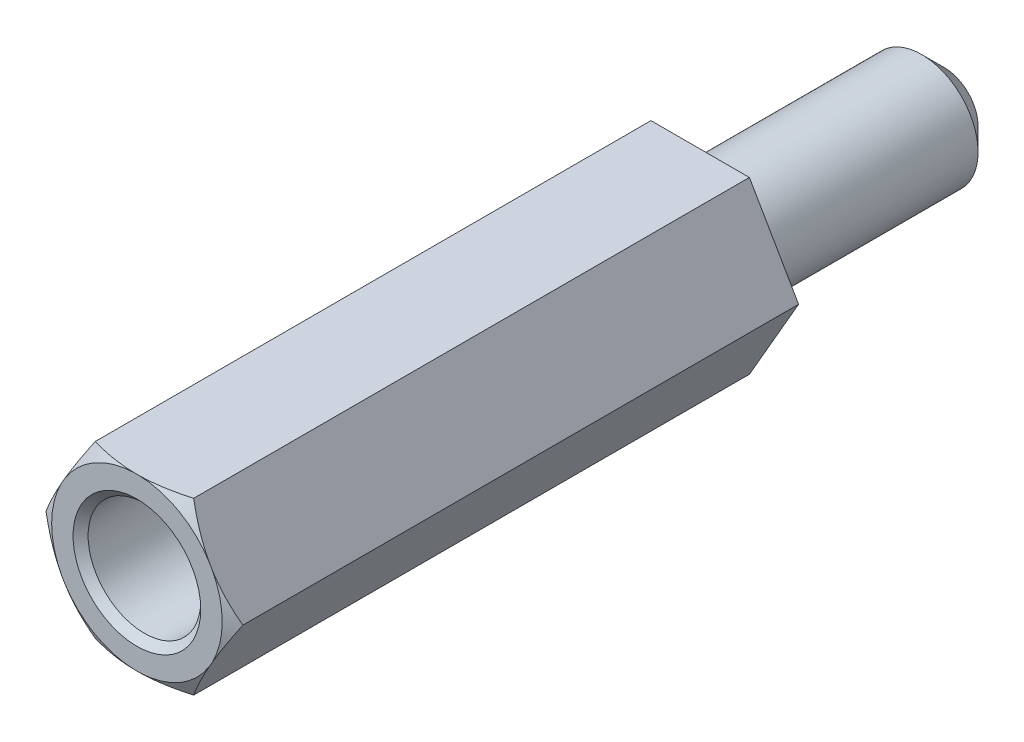
ISO-10303-21;
HEADER;
FILE_DESCRIPTION(('STEP AP214'),'2;1');
FILE_NAME('part.step','',(''),(''),'','','');
FILE_SCHEMA(('AUTOMOTIVE_DESIGN { 1 0 10303 214 1 1 1 1 }'));
ENDSEC;
DATA;
#1=APPLICATION_CONTEXT('core data for automotive mechanical design processes');
#2=APPLICATION_PROTOCOL_DEFINITION('international standard','automotive_design',2000,#1);
#3=PRODUCT_CONTEXT('',#1,'mechanical');
#4=PRODUCT('Part','Part','',(#3));
#5=PRODUCT_RELATED_PRODUCT_CATEGORY('part','',(#4));
#6=PRODUCT_DEFINITION_FORMATION('','',#4);
#7=PRODUCT_DEFINITION_CONTEXT('part definition',#1,'design');
#8=PRODUCT_DEFINITION('design','',#6,#7);
#9=PRODUCT_DEFINITION_SHAPE('','',#8);
#10=(LENGTH_UNIT() NAMED_UNIT(*) SI_UNIT(.MILLI.,.METRE.));
#11=(NAMED_UNIT(*) PLANE_ANGLE_UNIT() SI_UNIT($,.RADIAN.));
#12=(NAMED_UNIT(*) SI_UNIT($,.STERADIAN.) SOLID_ANGLE_UNIT());
#13=UNCERTAINTY_MEASURE_WITH_UNIT(LENGTH_MEASURE(1.E-05),#10,'distance_accuracy_value','');
#14=(GEOMETRIC_REPRESENTATION_CONTEXT(3) GLOBAL_UNCERTAINTY_ASSIGNED_CONTEXT((#13)) GLOBAL_UNIT_ASSIGNED_CONTEXT((#10,
#11,#12)) REPRESENTATION_CONTEXT('',''));
#15=CARTESIAN_POINT('',(0.,0.,0.));
#16=DIRECTION('',(0.,0.,1.));
#17=DIRECTION('',(1.,0.,0.));
#18=AXIS2_PLACEMENT_3D('',#15,#16,#17);
#19=CARTESIAN_POINT('',(0.,0.,15.));
#20=DIRECTION('',(0.,0.,1.));
#21=DIRECTION('',(1.,0.,0.));
#22=AXIS2_PLACEMENT_3D('',#19,#20,#21);
#23=PLANE('',#22);
#24=CARTESIAN_POINT('',(0.,0.,15.));
#25=DIRECTION('',(0.,0.,1.));
#26=DIRECTION('',(1.,0.,0.));
#27=AXIS2_PLACEMENT_3D('',#24,#25,#26);
#28=CIRCLE('',#27,1.7);
#29=CARTESIAN_POINT('',(1.7,0.,15.));
#30=VERTEX_POINT('',#29);
#31=EDGE_CURVE('E162',#30,#30,#28,.F.);
#32=ORIENTED_EDGE('',*,*,#31,.T.);
#33=EDGE_LOOP('',(#32));
#34=FACE_BOUND('',#33,.T.);
#35=CARTESIAN_POINT('',(0.,0.,15.));
#36=DIRECTION('',(0.,0.,1.));
#37=DIRECTION('',(1.,0.,0.));
#38=AXIS2_PLACEMENT_3D('',#35,#36,#37);
#39=CIRCLE('',#38,2.2711702221209);
#40=CARTESIAN_POINT('',(1.92942846272878,-1.19813187298425,15.));
#41=VERTEX_POINT('',#40);
#42=CARTESIAN_POINT('',(0.0728984077241117,-2.27,15.));
#43=VERTEX_POINT('',#42);
#44=EDGE_CURVE('E161',#41,#43,#39,.F.);
#45=ORIENTED_EDGE('',*,*,#44,.F.);
#46=DIRECTION('',(0.499999999999995,0.866025403784442,0.));
#47=VECTOR('',#46,1.);
#48=CARTESIAN_POINT('',(1.31058511106048,-2.26999999999999,15.));
#49=LINE('',#48,#47);
#50=CARTESIAN_POINT('',(2.0023268704526,-1.07186812701573,15.));
#51=VERTEX_POINT('',#50);
#52=EDGE_CURVE('E305',#41,#51,#49,.T.);
#53=ORIENTED_EDGE('',*,*,#52,.T.);
#54=CARTESIAN_POINT('',(2.00232687045272,1.0718681270155,15.));
#55=VERTEX_POINT('',#54);
#56=EDGE_CURVE('E158',#55,#51,#39,.F.);
#57=ORIENTED_EDGE('',*,*,#56,.F.);
#58=DIRECTION('',(-0.500000000000001,0.866025403784438,0.));
#59=VECTOR('',#58,1.);
#60=CARTESIAN_POINT('',(2.6211702221209,0.,15.));
#61=LINE('',#60,#59);
#62=CARTESIAN_POINT('',(1.92942846272862,1.19813187298451,15.));
#63=VERTEX_POINT('',#62);
#64=EDGE_CURVE('E317',#55,#63,#61,.T.);
#65=ORIENTED_EDGE('',*,*,#64,.T.);
#66=CARTESIAN_POINT('',(0.0728984077240801,2.27,15.));
#67=VERTEX_POINT('',#66);
#68=EDGE_CURVE('E160',#67,#63,#39,.F.);
#69=ORIENTED_EDGE('',*,*,#68,.F.);
#70=DIRECTION('',(-1.,0.,0.));
#71=VECTOR('',#70,1.);
#72=CARTESIAN_POINT('',(1.31058511106045,2.27,15.));
#73=LINE('',#72,#71);
#74=CARTESIAN_POINT('',(-0.0728984077240959,2.27,15.));
#75=VERTEX_POINT('',#74);
#76=EDGE_CURVE('E312',#67,#75,#73,.T.);
#77=ORIENTED_EDGE('',*,*,#76,.T.);
#78=CARTESIAN_POINT('',(-1.92942846272864,1.19813187298448,15.));
#79=VERTEX_POINT('',#78);
#80=EDGE_CURVE('E337',#79,#75,#39,.F.);
#81=ORIENTED_EDGE('',*,*,#80,.F.);
#82=DIRECTION('',(-0.499999999999995,-0.866025403784442,0.));
#83=VECTOR('',#82,1.);
#84=CARTESIAN_POINT('',(-1.31058511106046,2.27,15.));
#85=LINE('',#84,#83);
#86=CARTESIAN_POINT('',(-2.00232687045273,1.07186812701549,15.));
#87=VERTEX_POINT('',#86);
#88=EDGE_CURVE('E311',#79,#87,#85,.T.);
#89=ORIENTED_EDGE('',*,*,#88,.T.);
#90=CARTESIAN_POINT('',(-2.00232687045272,-1.07186812701551,15.));
#91=VERTEX_POINT('',#90);
#92=EDGE_CURVE('E122',#91,#87,#39,.F.);
#93=ORIENTED_EDGE('',*,*,#92,.F.);
#94=DIRECTION('',(0.500000000000007,-0.866025403784435,0.));
#95=VECTOR('',#94,1.);
#96=CARTESIAN_POINT('',(-2.6211702221209,0.,15.));
#97=LINE('',#96,#95);
#98=CARTESIAN_POINT('',(-1.92942846272862,-1.19813187298452,15.));
#99=VERTEX_POINT('',#98);
#100=EDGE_CURVE('E138',#91,#99,#97,.T.);
#101=ORIENTED_EDGE('',*,*,#100,.T.);
#102=CARTESIAN_POINT('',(-0.0728984077240643,-2.27,15.));
#103=VERTEX_POINT('',#102);
#104=EDGE_CURVE('E328',#103,#99,#39,.F.);
#105=ORIENTED_EDGE('',*,*,#104,.F.);
#106=DIRECTION('',(1.,0.,0.));
#107=VECTOR('',#106,1.);
#108=CARTESIAN_POINT('',(-1.31058511106043,-2.27000000000001,15.));
#109=LINE('',#108,#107);
#110=EDGE_CURVE('E297',#103,#43,#109,.T.);
#111=ORIENTED_EDGE('',*,*,#110,.T.);
#112=EDGE_LOOP('',(#45,#53,#57,#65,#69,#77,#81,#89,#93,#101,#105,#111));
#113=FACE_BOUND('',#112,.T.);
#114=ADVANCED_FACE('F33',(#34,#113),#23,.T.);
#115=CARTESIAN_POINT('',(1.31058511106048,-2.26999999999999,15.));
#116=DIRECTION('',(-0.866025403784442,0.499999999999995,0.));
#117=DIRECTION('',(-0.499999999999995,-0.866025403784442,0.));
#118=AXIS2_PLACEMENT_3D('',#115,#116,#117);
#119=PLANE('',#118);
#120=DIRECTION('',(0.,0.,-1.));
#121=VECTOR('',#120,1.);
#122=CARTESIAN_POINT('',(2.6211702221209,0.,15.));
#123=LINE('',#122,#121);
#124=CARTESIAN_POINT('',(2.6211702221209,0.,14.8));
#125=VERTEX_POINT('',#124);
#126=CARTESIAN_POINT('',(2.6211702221209,0.,0.));
#127=VERTEX_POINT('',#126);
#128=EDGE_CURVE('E156',#125,#127,#123,.T.);
#129=ORIENTED_EDGE('',*,*,#128,.F.);
#130=CARTESIAN_POINT('',(3.53192502802619,1.5774735970655,14.0874155357182));
#131=CARTESIAN_POINT('',(3.49038683177578,1.50552733070503,14.1258459368283));
#132=CARTESIAN_POINT('',(3.44875020540645,1.43341057837759,14.1638565423728));
#133=CARTESIAN_POINT('',(3.36523806633925,1.28876331046445,14.2388408708484));
#134=CARTESIAN_POINT('',(3.32336252393505,1.21623274342586,14.2758144613019));
#135=CARTESIAN_POINT('',(3.2392041639013,1.07046618796573,14.3486360571844));
#136=CARTESIAN_POINT('',(3.19692046373753,0.99722867095006,14.3844800017564));
#137=CARTESIAN_POINT('',(3.11203872815441,0.850209192285477,14.4546361454567));
#138=CARTESIAN_POINT('',(3.06944070287604,0.776427248201235,14.4889483937519));
#139=CARTESIAN_POINT('',(2.93902958582734,0.55054856760107,14.5907324723442));
#140=CARTESIAN_POINT('',(2.85063034563924,0.397436592244797,14.6552582519314));
#141=CARTESIAN_POINT('',(2.67192637782697,0.0879122404797901,14.7724545253547));
#142=CARTESIAN_POINT('',(2.58162393222905,-0.0684961833435461,14.8251384219436));
#143=CARTESIAN_POINT('',(2.42693241398784,-0.336429752437284,14.8992654299313));
#144=CARTESIAN_POINT('',(2.36310804900724,-0.446976795344509,14.9253337082215));
#145=CARTESIAN_POINT('',(2.23458545503782,-0.669584458020084,14.9666715963234));
#146=CARTESIAN_POINT('',(2.16988756118548,-0.781644497315037,14.9819452339838));
#147=CARTESIAN_POINT('',(2.04077595171339,-1.00527236476769,14.9998836306583));
#148=CARTESIAN_POINT('',(1.97636731130574,-1.11683140240018,15.0026891812466));
#149=CARTESIAN_POINT('',(1.8477221713502,-1.33965132094999,14.9957318097908));
#150=CARTESIAN_POINT('',(1.78348569252728,-1.4509121659706,14.9859674371621));
#151=CARTESIAN_POINT('',(1.63030365883248,-1.71623123113674,14.9488411027541));
#152=CARTESIAN_POINT('',(1.54169424329178,-1.86970724088221,14.9160238630181));
#153=CARTESIAN_POINT('',(1.36642171508064,-2.17328816491496,14.8337386865889));
#154=CARTESIAN_POINT('',(1.2797613139628,-2.32338838265536,14.7842489190442));
#155=CARTESIAN_POINT('',(1.10733311832966,-2.62204277814939,14.6734296043507));
#156=CARTESIAN_POINT('',(1.02158612689552,-2.77056092390949,14.6119739052285));
#157=CARTESIAN_POINT('',(0.851622526986733,-3.06494651438883,14.4814839194209));
#158=CARTESIAN_POINT('',(0.767405153907318,-3.21081528344236,14.4124535477672));
#159=CARTESIAN_POINT('',(0.635892107966438,-3.43860256087011,14.2999058489882));
#160=CARTESIAN_POINT('',(0.588222071353346,-3.52116948628265,14.258115008667));
#161=CARTESIAN_POINT('',(0.493605207664322,-3.68505070144486,14.1735241810497));
#162=CARTESIAN_POINT('',(0.44665570074096,-3.76636963282643,14.1307361997354));
#163=CARTESIAN_POINT('',(0.399830305155195,-3.84747359706549,14.0874155357182));
#164=B_SPLINE_CURVE_WITH_KNOTS('',3,(#130,#131,#132,#133,#134,#135,#136,#137,#138,#139,#140,
#141,#142,#143,#144,#145,#146,#147,#148,#149,#150,#151,#152,#153,#154,#155,#156,#157,#158,#159,
#160,#161,#162,#163),.UNSPECIFIED.,.F.,.F.,(4,2,2,2,2,2,2,2,2,2,2,2,2,2,2,2,4),(0.,
0.274606048832119,0.549247019939763,0.824783021018252,1.10031017110166,1.66467514911564,
2.22839812072204,2.61888273310891,3.00922156533173,3.39514124414461,3.78110546255822,
4.32061090335234,4.86082553106844,5.40707820220989,5.95304985633492,6.26533246804872,
6.57488685439788),.UNSPECIFIED.);
#165=EDGE_CURVE('E295',#125,#51,#164,.T.);
#166=ORIENTED_EDGE('',*,*,#165,.T.);
#167=ORIENTED_EDGE('',*,*,#52,.F.);
#168=CARTESIAN_POINT('',(1.31058511106048,-2.26999999999999,14.8));
#169=VERTEX_POINT('',#168);
#170=EDGE_CURVE('E139',#41,#169,#164,.T.);
#171=ORIENTED_EDGE('',*,*,#170,.T.);
#172=DIRECTION('',(0.,0.,-1.));
#173=VECTOR('',#172,1.);
#174=CARTESIAN_POINT('',(1.31058511106048,-2.26999999999999,15.));
#175=LINE('',#174,#173);
#176=CARTESIAN_POINT('',(1.31058511106048,-2.26999999999999,0.));
#177=VERTEX_POINT('',#176);
#178=EDGE_CURVE('E151',#169,#177,#175,.T.);
#179=ORIENTED_EDGE('',*,*,#178,.T.);
#180=DIRECTION('',(0.499999999999995,0.866025403784442,0.));
#181=VECTOR('',#180,1.);
#182=CARTESIAN_POINT('',(1.31058511106048,-2.26999999999999,0.));
#183=LINE('',#182,#181);
#184=EDGE_CURVE('E283',#177,#127,#183,.T.);
#185=ORIENTED_EDGE('',*,*,#184,.T.);
#186=EDGE_LOOP('',(#129,#166,#167,#171,#179,#185));
#187=FACE_BOUND('',#186,.T.);
#188=ADVANCED_FACE('F244',(#187),#119,.F.);
#189=CARTESIAN_POINT('',(2.6211702221209,0.,15.));
#190=DIRECTION('',(-0.866025403784438,-0.500000000000001,0.));
#191=DIRECTION('',(0.500000000000001,-0.866025403784438,0.));
#192=AXIS2_PLACEMENT_3D('',#189,#190,#191);
#193=PLANE('',#192);
#194=DIRECTION('',(0.,0.,-1.));
#195=VECTOR('',#194,1.);
#196=CARTESIAN_POINT('',(1.31058511106045,2.27,15.));
#197=LINE('',#196,#195);
#198=CARTESIAN_POINT('',(1.31058511106045,2.27,14.8));
#199=VERTEX_POINT('',#198);
#200=CARTESIAN_POINT('',(1.31058511106045,2.27,0.));
#201=VERTEX_POINT('',#200);
#202=EDGE_CURVE('E149',#199,#201,#197,.T.);
#203=ORIENTED_EDGE('',*,*,#202,.F.);
#204=CARTESIAN_POINT('',(0.399830305155137,3.84747359706553,14.0874155357182));
#205=CARTESIAN_POINT('',(0.441368501405546,3.77552733070505,14.1258459368283));
#206=CARTESIAN_POINT('',(0.483005127774877,3.70341057837761,14.1638565423728));
#207=CARTESIAN_POINT('',(0.566517266842072,3.55876331046447,14.2388408708484));
#208=CARTESIAN_POINT('',(0.608392809246275,3.48623274342589,14.2758144613019));
#209=CARTESIAN_POINT('',(0.692551169280027,3.34046618796575,14.3486360571844));
#210=CARTESIAN_POINT('',(0.734834869443803,3.26722867095009,14.3844800017564));
#211=CARTESIAN_POINT('',(0.819716605026918,3.1202091922855,14.4546361454567));
#212=CARTESIAN_POINT('',(0.86231463030529,3.04642724820126,14.4889483937519));
#213=CARTESIAN_POINT('',(0.992725747353993,2.8205485676011,14.5907324723442));
#214=CARTESIAN_POINT('',(1.08112498754209,2.66743659224482,14.6552582519314));
#215=CARTESIAN_POINT('',(1.25982895535436,2.35791224047982,14.7724545253546));
#216=CARTESIAN_POINT('',(1.35013140095229,2.20150381665648,14.8251384219436));
#217=CARTESIAN_POINT('',(1.5048229191935,1.93357024756274,14.8992654299313));
#218=CARTESIAN_POINT('',(1.5686472841741,1.82302320465552,14.9253337082215));
#219=CARTESIAN_POINT('',(1.69716987814352,1.60041554197995,14.9666715963234));
#220=CARTESIAN_POINT('',(1.76186777199586,1.488355502685,14.9819452339838));
#221=CARTESIAN_POINT('',(1.89097938146795,1.26472763523235,14.9998836306583));
#222=CARTESIAN_POINT('',(1.9553880218756,1.15316859759985,15.0026891812466));
#223=CARTESIAN_POINT('',(2.08403316183114,0.930348679050053,14.9957318097908));
#224=CARTESIAN_POINT('',(2.14826964065406,0.819087834029436,14.9859674371621));
#225=CARTESIAN_POINT('',(2.30145167434886,0.553768768863305,14.9488411027541));
#226=CARTESIAN_POINT('',(2.39006108988956,0.400292759117837,14.9160238630181));
#227=CARTESIAN_POINT('',(2.56533361810069,0.0967118350851051,14.8337386865889));
#228=CARTESIAN_POINT('',(2.65199401921854,-0.0533883826552937,14.7842489190443));
#229=CARTESIAN_POINT('',(2.82442221485167,-0.352042778149309,14.6734296043507));
#230=CARTESIAN_POINT('',(2.91016920628581,-0.500560923909411,14.6119739052286));
#231=CARTESIAN_POINT('',(3.0801328061946,-0.794946514388736,14.4814839194209));
#232=CARTESIAN_POINT('',(3.16435017927401,-0.940815283442262,14.4124535477673));
#233=CARTESIAN_POINT('',(3.2958632252149,-1.16860256087003,14.2999058489882));
#234=CARTESIAN_POINT('',(3.34353326182801,-1.2511694862826,14.258115008667));
#235=CARTESIAN_POINT('',(3.43815012551706,-1.41505070144485,14.1735241810497));
#236=CARTESIAN_POINT('',(3.48509963244043,-1.49636963282644,14.1307361997354));
#237=CARTESIAN_POINT('',(3.53192502802621,-1.57747359706552,14.0874155357182));
#238=B_SPLINE_CURVE_WITH_KNOTS('',3,(#204,#205,#206,#207,#208,#209,#210,#211,#212,#213,#214,
#215,#216,#217,#218,#219,#220,#221,#222,#223,#224,#225,#226,#227,#228,#229,#230,#231,#232,#233,
#234,#235,#236,#237),.UNSPECIFIED.,.F.,.F.,(4,2,2,2,2,2,2,2,2,2,2,2,2,2,2,2,4),(0.,
0.274606048832119,0.549247019939765,0.824783021018255,1.10031017110166,1.66467514911564,
2.22839812072205,2.61888273310891,3.00922156533173,3.39514124414461,3.78110546255822,
4.32061090335232,4.8608255310684,5.40707820220983,5.95304985633485,6.26533246804874,
6.57488685439798),.UNSPECIFIED.);
#239=EDGE_CURVE('E229',#199,#63,#238,.T.);
#240=ORIENTED_EDGE('',*,*,#239,.T.);
#241=ORIENTED_EDGE('',*,*,#64,.F.);
#242=EDGE_CURVE('E326',#55,#125,#238,.T.);
#243=ORIENTED_EDGE('',*,*,#242,.T.);
#244=ORIENTED_EDGE('',*,*,#128,.T.);
#245=DIRECTION('',(-0.500000000000001,0.866025403784438,0.));
#246=VECTOR('',#245,1.);
#247=CARTESIAN_POINT('',(2.6211702221209,0.,0.));
#248=LINE('',#247,#246);
#249=EDGE_CURVE('E288',#127,#201,#248,.T.);
#250=ORIENTED_EDGE('',*,*,#249,.T.);
#251=EDGE_LOOP('',(#203,#240,#241,#243,#244,#250));
#252=FACE_BOUND('',#251,.T.);
#253=ADVANCED_FACE('F239',(#252),#193,.F.);
#254=CARTESIAN_POINT('',(1.31058511106045,2.27,15.));
#255=DIRECTION('',(0.,-1.,0.));
#256=DIRECTION('',(1.,0.,0.));
#257=AXIS2_PLACEMENT_3D('',#254,#255,#256);
#258=PLANE('',#257);
#259=DIRECTION('',(0.,0.,-1.));
#260=VECTOR('',#259,1.);
#261=CARTESIAN_POINT('',(-1.31058511106046,2.27,15.));
#262=LINE('',#261,#260);
#263=CARTESIAN_POINT('',(-1.31058511106046,2.27,14.8));
#264=VERTEX_POINT('',#263);
#265=CARTESIAN_POINT('',(-1.31058511106046,2.27,0.));
#266=VERTEX_POINT('',#265);
#267=EDGE_CURVE('E146',#264,#266,#262,.T.);
#268=ORIENTED_EDGE('',*,*,#267,.F.);
#269=CARTESIAN_POINT('',(-2.88805870812598,2.26999999999999,14.1987324103343));
#270=CARTESIAN_POINT('',(-2.80547290408561,2.26999999999999,14.2358255324642));
#271=CARTESIAN_POINT('',(-2.72266390787582,2.26999999999999,14.2724300278097));
#272=CARTESIAN_POINT('',(-2.55650266128481,2.26999999999999,14.3444249566602));
#273=CARTESIAN_POINT('',(-2.47315031505662,2.26999999999999,14.3798151686686));
#274=CARTESIAN_POINT('',(-2.30548338672953,2.26999999999999,14.4492769222981));
#275=CARTESIAN_POINT('',(-2.22116623150816,2.26999999999999,14.4833422884396));
#276=CARTESIAN_POINT('',(-2.0518277990544,2.26999999999999,14.5496595457378));
#277=CARTESIAN_POINT('',(-1.96680655448943,2.26999999999999,14.5819115204949));
#278=CARTESIAN_POINT('',(-1.71138311857314,2.26999999999999,14.6750656041859));
#279=CARTESIAN_POINT('',(-1.53976972748374,2.26999999999999,14.7327268658694));
#280=CARTESIAN_POINT('',(-1.19280228070999,2.27,14.8349421604164));
#281=CARTESIAN_POINT('',(-1.01745424532613,2.27,14.879515794802));
#282=CARTESIAN_POINT('',(-0.712090771389105,2.27,14.9400719954737));
#283=CARTESIAN_POINT('',(-0.582987722953642,2.27,14.9605553386303));
#284=CARTESIAN_POINT('',(-0.323439084569075,2.27,14.989581233522));
#285=CARTESIAN_POINT('',(-0.192993977067367,2.27,14.9981279349084));
#286=CARTESIAN_POINT('',(0.0680599454393529,2.27,15.0022273630874));
#287=CARTESIAN_POINT('',(0.198668678458156,2.27,14.9977850727737));
#288=CARTESIAN_POINT('',(0.458851198221899,2.27,14.976485692699));
#289=CARTESIAN_POINT('',(0.588424742955648,2.27,14.9596257810572));
#290=CARTESIAN_POINT('',(0.90493775296269,2.27,14.9051607953018));
#291=CARTESIAN_POINT('',(1.09083477493519,2.27,14.8615794043185));
#292=CARTESIAN_POINT('',(1.36639728986907,2.27,14.7844964765957));
#293=CARTESIAN_POINT('',(1.45781153661094,2.27,14.7568102536344));
#294=CARTESIAN_POINT('',(1.63961899594479,2.27000000000001,14.6982591090532));
#295=CARTESIAN_POINT('',(1.73001229033942,2.27000000000001,14.6673944441364));
#296=CARTESIAN_POINT('',(1.91077257487059,2.27000000000001,14.6027837141474));
#297=CARTESIAN_POINT('',(2.00113026057095,2.27000000000001,14.5690119189924));
#298=CARTESIAN_POINT('',(2.18103313876786,2.27000000000001,14.499360278944));
#299=CARTESIAN_POINT('',(2.27057828364602,2.27000000000001,14.4634803114121));
#300=CARTESIAN_POINT('',(2.44846011178724,2.27000000000001,14.3902269588395));
#301=CARTESIAN_POINT('',(2.53680076536778,2.27000000000001,14.352863166806));
#302=CARTESIAN_POINT('',(2.71286376090328,2.27000000000001,14.2767584059864));
#303=CARTESIAN_POINT('',(2.80058623966965,2.27000000000001,14.2380177541729));
#304=CARTESIAN_POINT('',(2.88805870812597,2.27000000000001,14.1987324103343));
#305=B_SPLINE_CURVE_WITH_KNOTS('',3,(#269,#270,#271,#272,#273,#274,#275,#276,#277,#278,#279,
#280,#281,#282,#283,#284,#285,#286,#287,#288,#289,#290,#291,#292,#293,#294,#295,#296,#297,#298,
#299,#300,#301,#302,#303,#304),.UNSPECIFIED.,.F.,.F.,(4,2,2,2,2,2,2,2,2,2,2,2,2,2,2,2,2,4),(0.,
0.271603728461575,0.543256739373971,0.816052841064955,1.08883635604999,1.63163153509609,
2.17360956621751,2.56530041766828,2.95685506788357,3.3482595279036,3.73975296129815,
4.311415664863,4.59793246001126,4.88442613310068,5.17378506531957,5.46316084709715,
5.75090015934329,6.03857365362724),.UNSPECIFIED.);
#306=EDGE_CURVE('E221',#264,#75,#305,.T.);
#307=ORIENTED_EDGE('',*,*,#306,.T.);
#308=ORIENTED_EDGE('',*,*,#76,.F.);
#309=EDGE_CURVE('E228',#67,#199,#305,.T.);
#310=ORIENTED_EDGE('',*,*,#309,.T.);
#311=ORIENTED_EDGE('',*,*,#202,.T.);
#312=DIRECTION('',(-1.,0.,0.));
#313=VECTOR('',#312,1.);
#314=CARTESIAN_POINT('',(1.31058511106045,2.27,0.));
#315=LINE('',#314,#313);
#316=EDGE_CURVE('E292',#201,#266,#315,.T.);
#317=ORIENTED_EDGE('',*,*,#316,.T.);
#318=EDGE_LOOP('',(#268,#307,#308,#310,#311,#317));
#319=FACE_BOUND('',#318,.T.);
#320=ADVANCED_FACE('F236',(#319),#258,.F.);
#321=CARTESIAN_POINT('',(-1.31058511106046,2.27,15.));
#322=DIRECTION('',(0.866025403784442,-0.499999999999995,0.));
#323=DIRECTION('',(0.499999999999995,0.866025403784442,0.));
#324=AXIS2_PLACEMENT_3D('',#321,#322,#323);
#325=PLANE('',#324);
#326=DIRECTION('',(0.,0.,-1.));
#327=VECTOR('',#326,1.);
#328=CARTESIAN_POINT('',(-2.6211702221209,0.,15.));
#329=LINE('',#328,#327);
#330=CARTESIAN_POINT('',(-2.6211702221209,0.,14.8));
#331=VERTEX_POINT('',#330);
#332=CARTESIAN_POINT('',(-2.6211702221209,0.,0.));
#333=VERTEX_POINT('',#332);
#334=EDGE_CURVE('E134',#331,#333,#329,.T.);
#335=ORIENTED_EDGE('',*,*,#334,.F.);
#336=CARTESIAN_POINT('',(-3.5319250280262,-1.57747359706554,14.0874155357182));
#337=CARTESIAN_POINT('',(-3.49038683177579,-1.50552733070506,14.1258459368283));
#338=CARTESIAN_POINT('',(-3.44875020540646,-1.43341057837762,14.1638565423728));
#339=CARTESIAN_POINT('',(-3.36523806633926,-1.28876331046448,14.2388408708484));
#340=CARTESIAN_POINT('',(-3.32336252393506,-1.2162327434259,14.2758144613019));
#341=CARTESIAN_POINT('',(-3.23920416390131,-1.07046618796576,14.3486360571844));
#342=CARTESIAN_POINT('',(-3.19692046373754,-0.997228670950096,14.3844800017564));
#343=CARTESIAN_POINT('',(-3.11203872815442,-0.850209192285514,14.4546361454567));
#344=CARTESIAN_POINT('',(-3.06944070287605,-0.776427248201272,14.4889483937519));
#345=CARTESIAN_POINT('',(-2.93902958582735,-0.550548567601106,14.5907324723442));
#346=CARTESIAN_POINT('',(-2.85063034563925,-0.397436592244833,14.6552582519314));
#347=CARTESIAN_POINT('',(-2.67192637782698,-0.0879122404798257,14.7724545253547));
#348=CARTESIAN_POINT('',(-2.58162393222906,0.0684961833435107,14.8251384219436));
#349=CARTESIAN_POINT('',(-2.42693241398785,0.336429752437248,14.8992654299313));
#350=CARTESIAN_POINT('',(-2.36310804900725,0.446976795344472,14.9253337082215));
#351=CARTESIAN_POINT('',(-2.23458545503783,0.669584458020046,14.9666715963234));
#352=CARTESIAN_POINT('',(-2.16988756118549,0.781644497314998,14.9819452339838));
#353=CARTESIAN_POINT('',(-2.04077595171341,1.00527236476765,14.9998836306583));
#354=CARTESIAN_POINT('',(-1.97636731130575,1.11683140240014,15.0026891812466));
#355=CARTESIAN_POINT('',(-1.84772217135021,1.33965132094994,14.9957318097908));
#356=CARTESIAN_POINT('',(-1.7834856925273,1.45091216597056,14.9859674371621));
#357=CARTESIAN_POINT('',(-1.63030365883249,1.71623123113669,14.9488411027541));
#358=CARTESIAN_POINT('',(-1.5416942432918,1.86970724088216,14.9160238630181));
#359=CARTESIAN_POINT('',(-1.36642171508067,2.1732881649149,14.8337386865889));
#360=CARTESIAN_POINT('',(-1.27976131396282,2.3233883826553,14.7842489190443));
#361=CARTESIAN_POINT('',(-1.10733311832969,2.62204277814932,14.6734296043507));
#362=CARTESIAN_POINT('',(-1.02158612689555,2.77056092390942,14.6119739052286));
#363=CARTESIAN_POINT('',(-0.851622526986767,3.06494651438875,14.4814839194209));
#364=CARTESIAN_POINT('',(-0.767405153907355,3.21081528344228,14.4124535477672));
#365=CARTESIAN_POINT('',(-0.635892107966466,3.43860256087004,14.2999058489882));
#366=CARTESIAN_POINT('',(-0.588222071353363,3.5211694862826,14.258115008667));
#367=CARTESIAN_POINT('',(-0.493605207664317,3.68505070144485,14.1735241810497));
#368=CARTESIAN_POINT('',(-0.446655700740944,3.76636963282644,14.1307361997354));
#369=CARTESIAN_POINT('',(-0.399830305155168,3.84747359706552,14.0874155357182));
#370=B_SPLINE_CURVE_WITH_KNOTS('',3,(#336,#337,#338,#339,#340,#341,#342,#343,#344,#345,#346,
#347,#348,#349,#350,#351,#352,#353,#354,#355,#356,#357,#358,#359,#360,#361,#362,#363,#364,#365,
#366,#367,#368,#369),.UNSPECIFIED.,.F.,.F.,(4,2,2,2,2,2,2,2,2,2,2,2,2,2,2,2,4),(0.,
0.27460604883212,0.549247019939765,0.824783021018254,1.10031017110166,1.66467514911564,
2.22839812072205,2.61888273310891,3.00922156533173,3.39514124414461,3.78110546255822,
4.32061090335232,4.86082553106841,5.40707820220984,5.95304985633486,6.26533246804873,
6.57488685439796),.UNSPECIFIED.);
#371=EDGE_CURVE('E120',#331,#87,#370,.T.);
#372=ORIENTED_EDGE('',*,*,#371,.T.);
#373=ORIENTED_EDGE('',*,*,#88,.F.);
#374=EDGE_CURVE('E127',#79,#264,#370,.T.);
#375=ORIENTED_EDGE('',*,*,#374,.T.);
#376=ORIENTED_EDGE('',*,*,#267,.T.);
#377=DIRECTION('',(-0.499999999999995,-0.866025403784442,0.));
#378=VECTOR('',#377,1.);
#379=CARTESIAN_POINT('',(-1.31058511106046,2.27,0.));
#380=LINE('',#379,#378);
#381=EDGE_CURVE('E144',#266,#333,#380,.T.);
#382=ORIENTED_EDGE('',*,*,#381,.T.);
#383=EDGE_LOOP('',(#335,#372,#373,#375,#376,#382));
#384=FACE_BOUND('',#383,.T.);
#385=ADVANCED_FACE('F142',(#384),#325,.F.);
#386=CARTESIAN_POINT('',(-2.6211702221209,0.,15.));
#387=DIRECTION('',(0.866025403784435,0.500000000000007,0.));
#388=DIRECTION('',(-0.500000000000007,0.866025403784435,0.));
#389=AXIS2_PLACEMENT_3D('',#386,#387,#388);
#390=PLANE('',#389);
#391=DIRECTION('',(0.,0.,-1.));
#392=VECTOR('',#391,1.);
#393=CARTESIAN_POINT('',(-1.31058511106043,-2.27000000000001,15.));
#394=LINE('',#393,#392);
#395=CARTESIAN_POINT('',(-1.31058511106043,-2.27000000000001,14.8));
#396=VERTEX_POINT('',#395);
#397=CARTESIAN_POINT('',(-1.31058511106043,-2.27000000000001,0.));
#398=VERTEX_POINT('',#397);
#399=EDGE_CURVE('E147',#396,#398,#394,.T.);
#400=ORIENTED_EDGE('',*,*,#399,.F.);
#401=CARTESIAN_POINT('',(-0.399830305155107,-3.84747359706554,14.0874155357182));
#402=CARTESIAN_POINT('',(-0.441368501405516,-3.77552733070506,14.1258459368283));
#403=CARTESIAN_POINT('',(-0.483005127774847,-3.70341057837762,14.1638565423728));
#404=CARTESIAN_POINT('',(-0.566517266842044,-3.55876331046448,14.2388408708484));
#405=CARTESIAN_POINT('',(-0.608392809246247,-3.4862327434259,14.2758144613019));
#406=CARTESIAN_POINT('',(-0.69255116928,-3.34046618796576,14.3486360571844));
#407=CARTESIAN_POINT('',(-0.734834869443777,-3.2672286709501,14.3844800017564));
#408=CARTESIAN_POINT('',(-0.819716605026893,-3.12020919228552,14.4546361454567));
#409=CARTESIAN_POINT('',(-0.862314630305265,-3.04642724820127,14.4889483937519));
#410=CARTESIAN_POINT('',(-0.99272574735397,-2.82054856760111,14.5907324723442));
#411=CARTESIAN_POINT('',(-1.08112498754207,-2.66743659224484,14.6552582519314));
#412=CARTESIAN_POINT('',(-1.25982895535434,-2.35791224047983,14.7724545253546));
#413=CARTESIAN_POINT('',(-1.35013140095227,-2.2015038166565,14.8251384219436));
#414=CARTESIAN_POINT('',(-1.50482291919348,-1.93357024756276,14.8992654299313));
#415=CARTESIAN_POINT('',(-1.56864728417408,-1.82302320465554,14.9253337082215));
#416=CARTESIAN_POINT('',(-1.6971698781435,-1.60041554197997,14.9666715963234));
#417=CARTESIAN_POINT('',(-1.76186777199584,-1.48835550268501,14.9819452339838));
#418=CARTESIAN_POINT('',(-1.89097938146793,-1.26472763523237,14.9998836306583));
#419=CARTESIAN_POINT('',(-1.95538802187559,-1.15316859759987,15.0026891812466));
#420=CARTESIAN_POINT('',(-2.08403316183113,-0.930348679050072,14.9957318097908));
#421=CARTESIAN_POINT('',(-2.14826964065405,-0.819087834029455,14.9859674371621));
#422=CARTESIAN_POINT('',(-2.30145167434886,-0.553768768863327,14.9488411027541));
#423=CARTESIAN_POINT('',(-2.39006108988955,-0.40029275911786,14.9160238630181));
#424=CARTESIAN_POINT('',(-2.56533361810069,-0.0967118350851304,14.8337386865889));
#425=CARTESIAN_POINT('',(-2.65199401921853,0.0533883826552678,14.7842489190443));
#426=CARTESIAN_POINT('',(-2.82442221485167,0.352042778149282,14.6734296043507));
#427=CARTESIAN_POINT('',(-2.91016920628581,0.500560923909384,14.6119739052286));
#428=CARTESIAN_POINT('',(-3.0801328061946,0.794946514388706,14.4814839194209));
#429=CARTESIAN_POINT('',(-3.16435017927401,0.940815283442231,14.4124535477673));
#430=CARTESIAN_POINT('',(-3.29586322521491,1.16860256087,14.2999058489882));
#431=CARTESIAN_POINT('',(-3.34353326182801,1.25116948628257,14.258115008667));
#432=CARTESIAN_POINT('',(-3.43815012551707,1.41505070144483,14.1735241810497));
#433=CARTESIAN_POINT('',(-3.48509963244045,1.49636963282642,14.1307361997354));
#434=CARTESIAN_POINT('',(-3.53192502802623,1.5774735970655,14.0874155357182));
#435=B_SPLINE_CURVE_WITH_KNOTS('',3,(#401,#402,#403,#404,#405,#406,#407,#408,#409,#410,#411,
#412,#413,#414,#415,#416,#417,#418,#419,#420,#421,#422,#423,#424,#425,#426,#427,#428,#429,#430,
#431,#432,#433,#434),.UNSPECIFIED.,.F.,.F.,(4,2,2,2,2,2,2,2,2,2,2,2,2,2,2,2,4),(0.,
0.27460604883212,0.549247019939766,0.824783021018255,1.10031017110166,1.66467514911564,
2.22839812072205,2.61888273310892,3.00922156533174,3.39514124414461,3.78110546255822,
4.32061090335232,4.8608255310684,5.40707820220983,5.95304985633485,6.26533246804874,
6.57488685439799),.UNSPECIFIED.);
#436=EDGE_CURVE('E141',#396,#99,#435,.T.);
#437=ORIENTED_EDGE('',*,*,#436,.T.);
#438=ORIENTED_EDGE('',*,*,#100,.F.);
#439=EDGE_CURVE('E56',#91,#331,#435,.T.);
#440=ORIENTED_EDGE('',*,*,#439,.T.);
#441=ORIENTED_EDGE('',*,*,#334,.T.);
#442=DIRECTION('',(0.500000000000007,-0.866025403784435,0.));
#443=VECTOR('',#442,1.);
#444=CARTESIAN_POINT('',(-2.6211702221209,0.,0.));
#445=LINE('',#444,#443);
#446=EDGE_CURVE('E303',#333,#398,#445,.T.);
#447=ORIENTED_EDGE('',*,*,#446,.T.);
#448=EDGE_LOOP('',(#400,#437,#438,#440,#441,#447));
#449=FACE_BOUND('',#448,.T.);
#450=ADVANCED_FACE('F132',(#449),#390,.F.);
#451=CARTESIAN_POINT('',(-1.31058511106043,-2.27000000000001,15.));
#452=DIRECTION('',(0.,1.,0.));
#453=DIRECTION('',(-1.,0.,0.));
#454=AXIS2_PLACEMENT_3D('',#451,#452,#453);
#455=PLANE('',#454);
#456=ORIENTED_EDGE('',*,*,#178,.F.);
#457=CARTESIAN_POINT('',(2.888058708126,-2.26999999999997,14.1987324103343));
#458=CARTESIAN_POINT('',(2.80547290408563,-2.26999999999997,14.2358255324642));
#459=CARTESIAN_POINT('',(2.72266390787583,-2.26999999999997,14.2724300278097));
#460=CARTESIAN_POINT('',(2.55650266128482,-2.26999999999997,14.3444249566602));
#461=CARTESIAN_POINT('',(2.47315031505664,-2.26999999999997,14.3798151686686));
#462=CARTESIAN_POINT('',(2.30548338672954,-2.26999999999998,14.4492769222981));
#463=CARTESIAN_POINT('',(2.22116623150817,-2.26999999999998,14.4833422884396));
#464=CARTESIAN_POINT('',(2.05182779905442,-2.26999999999998,14.5496595457378));
#465=CARTESIAN_POINT('',(1.96680655448944,-2.26999999999998,14.5819115204949));
#466=CARTESIAN_POINT('',(1.71138311857315,-2.26999999999998,14.6750656041859));
#467=CARTESIAN_POINT('',(1.53976972748375,-2.26999999999998,14.7327268658694));
#468=CARTESIAN_POINT('',(1.19280228071001,-2.26999999999999,14.8349421604164));
#469=CARTESIAN_POINT('',(1.01745424532615,-2.26999999999999,14.879515794802));
#470=CARTESIAN_POINT('',(0.712090771389121,-2.26999999999999,14.9400719954737));
#471=CARTESIAN_POINT('',(0.582987722953657,-2.26999999999999,14.9605553386303));
#472=CARTESIAN_POINT('',(0.323439084569091,-2.27,14.989581233522));
#473=CARTESIAN_POINT('',(0.192993977067383,-2.27,14.9981279349084));
#474=CARTESIAN_POINT('',(-0.068059945439337,-2.27,15.0022273630874));
#475=CARTESIAN_POINT('',(-0.19866867845814,-2.27,14.9977850727737));
#476=CARTESIAN_POINT('',(-0.458851198221883,-2.27,14.976485692699));
#477=CARTESIAN_POINT('',(-0.588424742955632,-2.27000000000001,14.9596257810572));
#478=CARTESIAN_POINT('',(-0.904937752962675,-2.27000000000001,14.9051607953018));
#479=CARTESIAN_POINT('',(-1.09083477493517,-2.27000000000001,14.8615794043185));
#480=CARTESIAN_POINT('',(-1.36639728986905,-2.27000000000001,14.7844964765957));
#481=CARTESIAN_POINT('',(-1.45781153661093,-2.27000000000002,14.7568102536344));
#482=CARTESIAN_POINT('',(-1.63961899594477,-2.27000000000002,14.6982591090532));
#483=CARTESIAN_POINT('',(-1.73001229033941,-2.27000000000002,14.6673944441364));
#484=CARTESIAN_POINT('',(-1.91077257487057,-2.27000000000002,14.6027837141474));
#485=CARTESIAN_POINT('',(-2.00113026057093,-2.27000000000002,14.5690119189924));
#486=CARTESIAN_POINT('',(-2.18103313876785,-2.27000000000002,14.499360278944));
#487=CARTESIAN_POINT('',(-2.27057828364601,-2.27000000000002,14.4634803114121));
#488=CARTESIAN_POINT('',(-2.44846011178723,-2.27000000000003,14.3902269588395));
#489=CARTESIAN_POINT('',(-2.53680076536776,-2.27000000000003,14.352863166806));
#490=CARTESIAN_POINT('',(-2.71286376090327,-2.27000000000003,14.2767584059864));
#491=CARTESIAN_POINT('',(-2.80058623966963,-2.27000000000003,14.2380177541729));
#492=CARTESIAN_POINT('',(-2.88805870812595,-2.27000000000003,14.1987324103343));
#493=B_SPLINE_CURVE_WITH_KNOTS('',3,(#457,#458,#459,#460,#461,#462,#463,#464,#465,#466,#467,
#468,#469,#470,#471,#472,#473,#474,#475,#476,#477,#478,#479,#480,#481,#482,#483,#484,#485,#486,
#487,#488,#489,#490,#491,#492),.UNSPECIFIED.,.F.,.F.,(4,2,2,2,2,2,2,2,2,2,2,2,2,2,2,2,2,4),(0.,
0.271603728461576,0.543256739373972,0.816052841064955,1.08883635604999,1.63163153509609,
2.17360956621751,2.56530041766828,2.95685506788357,3.3482595279036,3.73975296129815,
4.311415664863,4.59793246001127,4.88442613310068,5.17378506531957,5.46316084709716,
5.75090015934329,6.03857365362724),.UNSPECIFIED.);
#494=EDGE_CURVE('E182',#169,#43,#493,.T.);
#495=ORIENTED_EDGE('',*,*,#494,.T.);
#496=ORIENTED_EDGE('',*,*,#110,.F.);
#497=EDGE_CURVE('E48',#103,#396,#493,.T.);
#498=ORIENTED_EDGE('',*,*,#497,.T.);
#499=ORIENTED_EDGE('',*,*,#399,.T.);
#500=DIRECTION('',(1.,0.,0.));
#501=VECTOR('',#500,1.);
#502=CARTESIAN_POINT('',(-1.31058511106043,-2.27000000000001,0.));
#503=LINE('',#502,#501);
#504=EDGE_CURVE('E285',#398,#177,#503,.T.);
#505=ORIENTED_EDGE('',*,*,#504,.T.);
#506=EDGE_LOOP('',(#456,#495,#496,#498,#499,#505));
#507=FACE_BOUND('',#506,.T.);
#508=ADVANCED_FACE('F189',(#507),#455,.F.);
#509=CARTESIAN_POINT('',(0.,0.,0.));
#510=DIRECTION('',(0.,0.,1.));
#511=DIRECTION('',(1.,0.,0.));
#512=AXIS2_PLACEMENT_3D('',#509,#510,#511);
#513=PLANE('',#512);
#514=CARTESIAN_POINT('',(0.,0.,0.));
#515=DIRECTION('',(0.,0.,-1.));
#516=DIRECTION('',(-1.,0.,0.));
#517=AXIS2_PLACEMENT_3D('',#514,#515,#516);
#518=CIRCLE('',#517,1.5);
#519=CARTESIAN_POINT('',(-1.5,0.,0.));
#520=VERTEX_POINT('',#519);
#521=EDGE_CURVE('E167',#520,#520,#518,.T.);
#522=ORIENTED_EDGE('',*,*,#521,.F.);
#523=EDGE_LOOP('',(#522));
#524=FACE_BOUND('',#523,.T.);
#525=ORIENTED_EDGE('',*,*,#184,.F.);
#526=ORIENTED_EDGE('',*,*,#504,.F.);
#527=ORIENTED_EDGE('',*,*,#446,.F.);
#528=ORIENTED_EDGE('',*,*,#381,.F.);
#529=ORIENTED_EDGE('',*,*,#316,.F.);
#530=ORIENTED_EDGE('',*,*,#249,.F.);
#531=EDGE_LOOP('',(#525,#526,#527,#528,#529,#530));
#532=FACE_BOUND('',#531,.T.);
#533=ADVANCED_FACE('F269',(#524,#532),#513,.F.);
#534=CARTESIAN_POINT('',(0.,0.,15.000012));
#535=DIRECTION('',(0.,0.,-1.));
#536=DIRECTION('',(-1.,0.,0.));
#537=AXIS2_PLACEMENT_3D('',#534,#535,#536);
#538=CYLINDRICAL_SURFACE('',#537,1.5);
#539=CARTESIAN_POINT('',(0.,0.,14.8));
#540=DIRECTION('',(0.,0.,1.));
#541=DIRECTION('',(1.,0.,0.));
#542=AXIS2_PLACEMENT_3D('',#539,#540,#541);
#543=CIRCLE('',#542,1.5);
#544=CARTESIAN_POINT('',(1.5,0.,14.8));
#545=VERTEX_POINT('',#544);
#546=EDGE_CURVE('E165',#545,#545,#543,.T.);
#547=ORIENTED_EDGE('',*,*,#546,.T.);
#548=EDGE_LOOP('',(#547));
#549=FACE_BOUND('',#548,.T.);
#550=CARTESIAN_POINT('',(0.,0.,3.));
#551=DIRECTION('',(0.,0.,1.));
#552=DIRECTION('',(1.,0.,0.));
#553=AXIS2_PLACEMENT_3D('',#550,#551,#552);
#554=CIRCLE('',#553,1.5);
#555=CARTESIAN_POINT('',(1.5,0.,3.));
#556=VERTEX_POINT('',#555);
#557=EDGE_CURVE('E290',#556,#556,#554,.T.);
#558=ORIENTED_EDGE('',*,*,#557,.F.);
#559=EDGE_LOOP('',(#558));
#560=FACE_BOUND('',#559,.T.);
#561=ADVANCED_FACE('F268',(#549,#560),#538,.F.);
#562=CARTESIAN_POINT('',(0.,0.,3.));
#563=DIRECTION('',(0.,0.,1.));
#564=DIRECTION('',(1.,0.,0.));
#565=AXIS2_PLACEMENT_3D('',#562,#563,#564);
#566=PLANE('',#565);
#567=ORIENTED_EDGE('',*,*,#557,.T.);
#568=EDGE_LOOP('',(#567));
#569=FACE_BOUND('',#568,.T.);
#570=ADVANCED_FACE('F198',(#569),#566,.T.);
#571=CARTESIAN_POINT('',(0.,0.,15.));
#572=DIRECTION('',(0.,0.,-1.));
#573=DIRECTION('',(-1.,0.,0.));
#574=AXIS2_PLACEMENT_3D('',#571,#572,#573);
#575=CONICAL_SURFACE('',#574,2.2711702221209,1.05165021254837);
#576=ORIENTED_EDGE('',*,*,#242,.F.);
#577=ORIENTED_EDGE('',*,*,#56,.T.);
#578=ORIENTED_EDGE('',*,*,#165,.F.);
#579=EDGE_LOOP('',(#576,#577,#578));
#580=FACE_BOUND('',#579,.T.);
#581=ADVANCED_FACE('F192',(#580),#575,.T.);
#582=ORIENTED_EDGE('',*,*,#309,.F.);
#583=ORIENTED_EDGE('',*,*,#68,.T.);
#584=ORIENTED_EDGE('',*,*,#239,.F.);
#585=EDGE_LOOP('',(#582,#583,#584));
#586=FACE_BOUND('',#585,.T.);
#587=ADVANCED_FACE('F197',(#586),#575,.T.);
#588=ORIENTED_EDGE('',*,*,#374,.F.);
#589=ORIENTED_EDGE('',*,*,#80,.T.);
#590=ORIENTED_EDGE('',*,*,#306,.F.);
#591=EDGE_LOOP('',(#588,#589,#590));
#592=FACE_BOUND('',#591,.T.);
#593=ADVANCED_FACE('F340',(#592),#575,.T.);
#594=ORIENTED_EDGE('',*,*,#439,.F.);
#595=ORIENTED_EDGE('',*,*,#92,.T.);
#596=ORIENTED_EDGE('',*,*,#371,.F.);
#597=EDGE_LOOP('',(#594,#595,#596));
#598=FACE_BOUND('',#597,.T.);
#599=ADVANCED_FACE('F121',(#598),#575,.T.);
#600=ORIENTED_EDGE('',*,*,#497,.F.);
#601=ORIENTED_EDGE('',*,*,#104,.T.);
#602=ORIENTED_EDGE('',*,*,#436,.F.);
#603=EDGE_LOOP('',(#600,#601,#602));
#604=FACE_BOUND('',#603,.T.);
#605=ADVANCED_FACE('F200',(#604),#575,.T.);
#606=ORIENTED_EDGE('',*,*,#44,.T.);
#607=ORIENTED_EDGE('',*,*,#494,.F.);
#608=ORIENTED_EDGE('',*,*,#170,.F.);
#609=EDGE_LOOP('',(#606,#607,#608));
#610=FACE_BOUND('',#609,.T.);
#611=ADVANCED_FACE('F251',(#610),#575,.T.);
#612=CARTESIAN_POINT('',(0.,0.,15.));
#613=DIRECTION('',(0.,0.,1.));
#614=DIRECTION('',(1.,0.,0.));
#615=AXIS2_PLACEMENT_3D('',#612,#613,#614);
#616=CONICAL_SURFACE('',#615,1.7,0.785398163397442);
#617=ORIENTED_EDGE('',*,*,#546,.F.);
#618=EDGE_LOOP('',(#617));
#619=FACE_BOUND('',#618,.T.);
#620=ORIENTED_EDGE('',*,*,#31,.F.);
#621=EDGE_LOOP('',(#620));
#622=FACE_BOUND('',#621,.T.);
#623=ADVANCED_FACE('F249',(#619,#622),#616,.F.);
#624=CARTESIAN_POINT('',(0.,0.,-6.5));
#625=DIRECTION('',(0.,0.,1.));
#626=DIRECTION('',(1.,0.,0.));
#627=AXIS2_PLACEMENT_3D('',#624,#625,#626);
#628=CYLINDRICAL_SURFACE('',#627,1.5);
#629=CARTESIAN_POINT('',(0.,0.,-5.90000000000001));
#630=DIRECTION('',(0.,0.,-1.));
#631=DIRECTION('',(-1.,0.,0.));
#632=AXIS2_PLACEMENT_3D('',#629,#630,#631);
#633=CIRCLE('',#632,1.5);
#634=CARTESIAN_POINT('',(-1.5,0.,-5.90000000000001));
#635=VERTEX_POINT('',#634);
#636=EDGE_CURVE('E11',#635,#635,#633,.F.);
#637=ORIENTED_EDGE('',*,*,#636,.T.);
#638=EDGE_LOOP('',(#637));
#639=FACE_BOUND('',#638,.T.);
#640=ORIENTED_EDGE('',*,*,#521,.T.);
#641=EDGE_LOOP('',(#640));
#642=FACE_BOUND('',#641,.T.);
#643=ADVANCED_FACE('F201',(#639,#642),#628,.T.);
#644=CARTESIAN_POINT('',(0.,0.,-6.5));
#645=DIRECTION('',(0.,0.,-1.));
#646=DIRECTION('',(-1.,0.,0.));
#647=AXIS2_PLACEMENT_3D('',#644,#645,#646);
#648=PLANE('',#647);
#649=CARTESIAN_POINT('',(0.,0.,-6.5));
#650=DIRECTION('',(0.,0.,-1.));
#651=DIRECTION('',(-1.,0.,0.));
#652=AXIS2_PLACEMENT_3D('',#649,#650,#651);
#653=CIRCLE('',#652,0.900000000000012);
#654=CARTESIAN_POINT('',(-0.900000000000012,0.,-6.5));
#655=VERTEX_POINT('',#654);
#656=EDGE_CURVE('E41',#655,#655,#653,.T.);
#657=ORIENTED_EDGE('',*,*,#656,.T.);
#658=EDGE_LOOP('',(#657));
#659=FACE_BOUND('',#658,.T.);
#660=ADVANCED_FACE('F257',(#659),#648,.T.);
#661=CARTESIAN_POINT('',(0.,0.,-6.5));
#662=DIRECTION('',(0.,0.,1.));
#663=DIRECTION('',(1.,0.,0.));
#664=AXIS2_PLACEMENT_3D('',#661,#662,#663);
#665=CONICAL_SURFACE('',#664,0.900000000000012,0.785398163397447);
#666=ORIENTED_EDGE('',*,*,#636,.F.);
#667=EDGE_LOOP('',(#666));
#668=FACE_BOUND('',#667,.T.);
#669=ORIENTED_EDGE('',*,*,#656,.F.);
#670=EDGE_LOOP('',(#669));
#671=FACE_BOUND('',#670,.T.);
#672=ADVANCED_FACE('F35',(#668,#671),#665,.T.);
#673=CLOSED_SHELL('',(#114,#188,#253,#320,#385,#450,#508,#533,#561,#570,#581,#587,#593,#599,
#605,#611,#623,#643,#660,#672));
#674=MANIFOLD_SOLID_BREP('B2',#673);
#675=ADVANCED_BREP_SHAPE_REPRESENTATION('',(#18,#674),#14);
#676=SHAPE_DEFINITION_REPRESENTATION(#9,#675);
ENDSEC;
END-ISO-10303-21;
